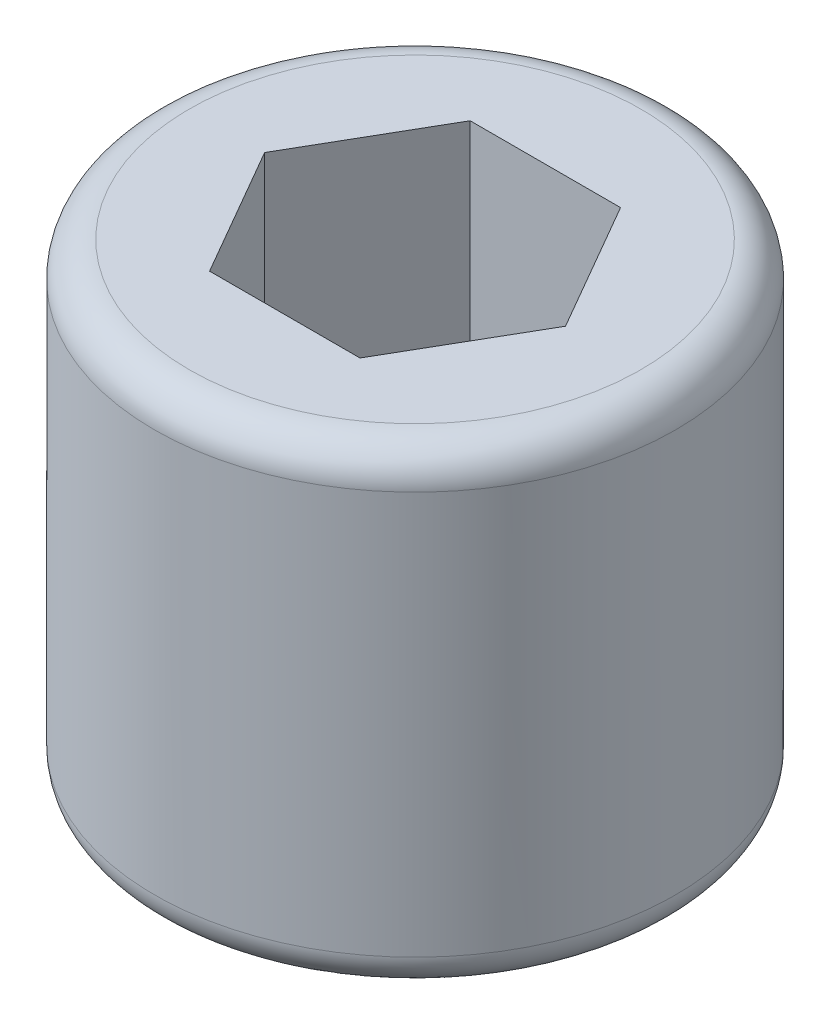
ISO-10303-21;
HEADER;
FILE_DESCRIPTION(('STEP AP214'),'2;1');
FILE_NAME('part.step','',(''),(''),'','','');
FILE_SCHEMA(('AUTOMOTIVE_DESIGN { 1 0 10303 214 1 1 1 1 }'));
ENDSEC;
DATA;
#1=APPLICATION_CONTEXT('core data for automotive mechanical design processes');
#2=APPLICATION_PROTOCOL_DEFINITION('international standard','automotive_design',2000,#1);
#3=PRODUCT_CONTEXT('',#1,'mechanical');
#4=PRODUCT('Part','Part','',(#3));
#5=PRODUCT_RELATED_PRODUCT_CATEGORY('part','',(#4));
#6=PRODUCT_DEFINITION_FORMATION('','',#4);
#7=PRODUCT_DEFINITION_CONTEXT('part definition',#1,'design');
#8=PRODUCT_DEFINITION('design','',#6,#7);
#9=PRODUCT_DEFINITION_SHAPE('','',#8);
#10=(LENGTH_UNIT() NAMED_UNIT(*) SI_UNIT(.MILLI.,.METRE.));
#11=(NAMED_UNIT(*) PLANE_ANGLE_UNIT() SI_UNIT($,.RADIAN.));
#12=(NAMED_UNIT(*) SI_UNIT($,.STERADIAN.) SOLID_ANGLE_UNIT());
#13=UNCERTAINTY_MEASURE_WITH_UNIT(LENGTH_MEASURE(1.E-05),#10,'distance_accuracy_value','');
#14=(GEOMETRIC_REPRESENTATION_CONTEXT(3) GLOBAL_UNCERTAINTY_ASSIGNED_CONTEXT((#13)) GLOBAL_UNIT_ASSIGNED_CONTEXT((#10,
#11,#12)) REPRESENTATION_CONTEXT('',''));
#15=CARTESIAN_POINT('',(0.,0.,0.));
#16=DIRECTION('',(0.,0.,1.));
#17=DIRECTION('',(1.,0.,0.));
#18=AXIS2_PLACEMENT_3D('',#15,#16,#17);
#19=CARTESIAN_POINT('',(0.,3.,0.));
#20=DIRECTION('',(0.,-1.,0.));
#21=DIRECTION('',(0.,0.,-1.));
#22=AXIS2_PLACEMENT_3D('',#19,#20,#21);
#23=CYLINDRICAL_SURFACE('',#22,1.5);
#24=CARTESIAN_POINT('',(0.,2.8,0.));
#25=DIRECTION('',(0.,1.,0.));
#26=DIRECTION('',(0.,0.,1.));
#27=AXIS2_PLACEMENT_3D('',#24,#25,#26);
#28=CIRCLE('',#27,1.5);
#29=CARTESIAN_POINT('',(0.,2.8,1.5));
#30=VERTEX_POINT('',#29);
#31=EDGE_CURVE('E43',#30,#30,#28,.F.);
#32=ORIENTED_EDGE('',*,*,#31,.T.);
#33=EDGE_LOOP('',(#32));
#34=FACE_BOUND('',#33,.T.);
#35=CARTESIAN_POINT('',(0.,0.481495457622373,0.));
#36=DIRECTION('',(0.,-1.,0.));
#37=DIRECTION('',(0.,0.,-1.));
#38=AXIS2_PLACEMENT_3D('',#35,#36,#37);
#39=CIRCLE('',#38,1.5);
#40=CARTESIAN_POINT('',(0.,0.481495457622373,-1.5));
#41=VERTEX_POINT('',#40);
#42=EDGE_CURVE('E146',#41,#41,#39,.F.);
#43=ORIENTED_EDGE('',*,*,#42,.T.);
#44=EDGE_LOOP('',(#43));
#45=FACE_BOUND('',#44,.T.);
#46=ADVANCED_FACE('F35',(#34,#45),#23,.T.);
#47=CARTESIAN_POINT('',(0.,3.,0.));
#48=DIRECTION('',(0.,1.,0.));
#49=DIRECTION('',(0.,0.,1.));
#50=AXIS2_PLACEMENT_3D('',#47,#48,#49);
#51=PLANE('',#50);
#52=CARTESIAN_POINT('',(0.,3.,0.));
#53=DIRECTION('',(0.,1.,0.));
#54=DIRECTION('',(0.,0.,1.));
#55=AXIS2_PLACEMENT_3D('',#52,#53,#54);
#56=CIRCLE('',#55,1.3);
#57=CARTESIAN_POINT('',(0.,3.,1.3));
#58=VERTEX_POINT('',#57);
#59=EDGE_CURVE('E138',#58,#58,#56,.T.);
#60=ORIENTED_EDGE('',*,*,#59,.T.);
#61=EDGE_LOOP('',(#60));
#62=FACE_BOUND('',#61,.T.);
#63=DIRECTION('',(0.5,0.,-0.866025403784439));
#64=VECTOR('',#63,1.);
#65=CARTESIAN_POINT('',(0.433012701892219,3.,0.75));
#66=LINE('',#65,#64);
#67=CARTESIAN_POINT('',(0.433012701892219,3.,0.75));
#68=VERTEX_POINT('',#67);
#69=CARTESIAN_POINT('',(0.866025403784439,3.,0.));
#70=VERTEX_POINT('',#69);
#71=EDGE_CURVE('E50',#68,#70,#66,.T.);
#72=ORIENTED_EDGE('',*,*,#71,.F.);
#73=DIRECTION('',(1.,0.,0.));
#74=VECTOR('',#73,1.);
#75=CARTESIAN_POINT('',(-0.43301270189222,3.,0.75));
#76=LINE('',#75,#74);
#77=CARTESIAN_POINT('',(-0.43301270189222,3.,0.75));
#78=VERTEX_POINT('',#77);
#79=EDGE_CURVE('E134',#78,#68,#76,.T.);
#80=ORIENTED_EDGE('',*,*,#79,.F.);
#81=DIRECTION('',(0.5,0.,0.866025403784439));
#82=VECTOR('',#81,1.);
#83=CARTESIAN_POINT('',(-0.866025403784439,3.,0.));
#84=LINE('',#83,#82);
#85=CARTESIAN_POINT('',(-0.866025403784439,3.,0.));
#86=VERTEX_POINT('',#85);
#87=EDGE_CURVE('E132',#86,#78,#84,.T.);
#88=ORIENTED_EDGE('',*,*,#87,.F.);
#89=DIRECTION('',(-0.5,0.,0.866025403784439));
#90=VECTOR('',#89,1.);
#91=CARTESIAN_POINT('',(-0.433012701892219,3.,-0.75));
#92=LINE('',#91,#90);
#93=CARTESIAN_POINT('',(-0.433012701892219,3.,-0.75));
#94=VERTEX_POINT('',#93);
#95=EDGE_CURVE('E98',#94,#86,#92,.T.);
#96=ORIENTED_EDGE('',*,*,#95,.F.);
#97=DIRECTION('',(-1.,0.,0.));
#98=VECTOR('',#97,1.);
#99=CARTESIAN_POINT('',(0.433012701892219,3.,-0.75));
#100=LINE('',#99,#98);
#101=CARTESIAN_POINT('',(0.433012701892219,3.,-0.75));
#102=VERTEX_POINT('',#101);
#103=EDGE_CURVE('E128',#102,#94,#100,.T.);
#104=ORIENTED_EDGE('',*,*,#103,.F.);
#105=DIRECTION('',(-0.5,0.,-0.866025403784439));
#106=VECTOR('',#105,1.);
#107=CARTESIAN_POINT('',(0.866025403784439,3.,0.));
#108=LINE('',#107,#106);
#109=EDGE_CURVE('E124',#70,#102,#108,.T.);
#110=ORIENTED_EDGE('',*,*,#109,.F.);
#111=EDGE_LOOP('',(#72,#80,#88,#96,#104,#110));
#112=FACE_BOUND('',#111,.T.);
#113=ADVANCED_FACE('F159',(#62,#112),#51,.T.);
#114=CARTESIAN_POINT('',(0.433012701892219,1.8,0.75));
#115=DIRECTION('',(0.866025403784439,0.,0.5));
#116=DIRECTION('',(0.5,0.,-0.866025403784439));
#117=AXIS2_PLACEMENT_3D('',#114,#115,#116);
#118=PLANE('',#117);
#119=ORIENTED_EDGE('',*,*,#71,.T.);
#120=DIRECTION('',(0.,1.,0.));
#121=VECTOR('',#120,1.);
#122=CARTESIAN_POINT('',(0.866025403784439,1.8,0.));
#123=LINE('',#122,#121);
#124=CARTESIAN_POINT('',(0.866025403784439,1.8,0.));
#125=VERTEX_POINT('',#124);
#126=EDGE_CURVE('E80',#125,#70,#123,.T.);
#127=ORIENTED_EDGE('',*,*,#126,.F.);
#128=DIRECTION('',(0.5,0.,-0.866025403784439));
#129=VECTOR('',#128,1.);
#130=CARTESIAN_POINT('',(0.433012701892219,1.8,0.75));
#131=LINE('',#130,#129);
#132=CARTESIAN_POINT('',(0.433012701892219,1.8,0.75));
#133=VERTEX_POINT('',#132);
#134=EDGE_CURVE('E136',#133,#125,#131,.T.);
#135=ORIENTED_EDGE('',*,*,#134,.F.);
#136=DIRECTION('',(0.,1.,0.));
#137=VECTOR('',#136,1.);
#138=CARTESIAN_POINT('',(0.433012701892219,1.8,0.75));
#139=LINE('',#138,#137);
#140=EDGE_CURVE('E58',#133,#68,#139,.T.);
#141=ORIENTED_EDGE('',*,*,#140,.T.);
#142=EDGE_LOOP('',(#119,#127,#135,#141));
#143=FACE_BOUND('',#142,.T.);
#144=ADVANCED_FACE('F162',(#143),#118,.F.);
#145=CARTESIAN_POINT('',(-0.43301270189222,1.8,0.75));
#146=DIRECTION('',(0.,0.,1.));
#147=DIRECTION('',(1.,0.,0.));
#148=AXIS2_PLACEMENT_3D('',#145,#146,#147);
#149=PLANE('',#148);
#150=ORIENTED_EDGE('',*,*,#79,.T.);
#151=ORIENTED_EDGE('',*,*,#140,.F.);
#152=DIRECTION('',(1.,0.,0.));
#153=VECTOR('',#152,1.);
#154=CARTESIAN_POINT('',(-0.43301270189222,1.8,0.75));
#155=LINE('',#154,#153);
#156=CARTESIAN_POINT('',(-0.43301270189222,1.8,0.75));
#157=VERTEX_POINT('',#156);
#158=EDGE_CURVE('E110',#157,#133,#155,.T.);
#159=ORIENTED_EDGE('',*,*,#158,.F.);
#160=DIRECTION('',(0.,1.,0.));
#161=VECTOR('',#160,1.);
#162=CARTESIAN_POINT('',(-0.43301270189222,1.8,0.75));
#163=LINE('',#162,#161);
#164=EDGE_CURVE('E102',#157,#78,#163,.T.);
#165=ORIENTED_EDGE('',*,*,#164,.T.);
#166=EDGE_LOOP('',(#150,#151,#159,#165));
#167=FACE_BOUND('',#166,.T.);
#168=ADVANCED_FACE('F198',(#167),#149,.F.);
#169=CARTESIAN_POINT('',(-0.866025403784439,1.8,0.));
#170=DIRECTION('',(-0.866025403784439,0.,0.5));
#171=DIRECTION('',(0.5,0.,0.866025403784439));
#172=AXIS2_PLACEMENT_3D('',#169,#170,#171);
#173=PLANE('',#172);
#174=ORIENTED_EDGE('',*,*,#87,.T.);
#175=ORIENTED_EDGE('',*,*,#164,.F.);
#176=DIRECTION('',(0.5,0.,0.866025403784439));
#177=VECTOR('',#176,1.);
#178=CARTESIAN_POINT('',(-0.866025403784439,1.8,0.));
#179=LINE('',#178,#177);
#180=CARTESIAN_POINT('',(-0.866025403784439,1.8,0.));
#181=VERTEX_POINT('',#180);
#182=EDGE_CURVE('E106',#181,#157,#179,.T.);
#183=ORIENTED_EDGE('',*,*,#182,.F.);
#184=DIRECTION('',(0.,1.,0.));
#185=VECTOR('',#184,1.);
#186=CARTESIAN_POINT('',(-0.866025403784439,1.8,0.));
#187=LINE('',#186,#185);
#188=EDGE_CURVE('E91',#181,#86,#187,.T.);
#189=ORIENTED_EDGE('',*,*,#188,.T.);
#190=EDGE_LOOP('',(#174,#175,#183,#189));
#191=FACE_BOUND('',#190,.T.);
#192=ADVANCED_FACE('F107',(#191),#173,.F.);
#193=CARTESIAN_POINT('',(-0.433012701892219,1.8,-0.75));
#194=DIRECTION('',(-0.866025403784439,0.,-0.5));
#195=DIRECTION('',(-0.5,0.,0.866025403784439));
#196=AXIS2_PLACEMENT_3D('',#193,#194,#195);
#197=PLANE('',#196);
#198=ORIENTED_EDGE('',*,*,#95,.T.);
#199=ORIENTED_EDGE('',*,*,#188,.F.);
#200=DIRECTION('',(-0.5,0.,0.866025403784439));
#201=VECTOR('',#200,1.);
#202=CARTESIAN_POINT('',(-0.433012701892219,1.8,-0.75));
#203=LINE('',#202,#201);
#204=CARTESIAN_POINT('',(-0.433012701892219,1.8,-0.75));
#205=VERTEX_POINT('',#204);
#206=EDGE_CURVE('E95',#205,#181,#203,.T.);
#207=ORIENTED_EDGE('',*,*,#206,.F.);
#208=DIRECTION('',(0.,1.,0.));
#209=VECTOR('',#208,1.);
#210=CARTESIAN_POINT('',(-0.433012701892219,1.8,-0.75));
#211=LINE('',#210,#209);
#212=EDGE_CURVE('E103',#205,#94,#211,.T.);
#213=ORIENTED_EDGE('',*,*,#212,.T.);
#214=EDGE_LOOP('',(#198,#199,#207,#213));
#215=FACE_BOUND('',#214,.T.);
#216=ADVANCED_FACE('F93',(#215),#197,.F.);
#217=CARTESIAN_POINT('',(0.433012701892219,1.8,-0.75));
#218=DIRECTION('',(0.,0.,-1.));
#219=DIRECTION('',(-1.,0.,0.));
#220=AXIS2_PLACEMENT_3D('',#217,#218,#219);
#221=PLANE('',#220);
#222=ORIENTED_EDGE('',*,*,#103,.T.);
#223=ORIENTED_EDGE('',*,*,#212,.F.);
#224=DIRECTION('',(-1.,0.,0.));
#225=VECTOR('',#224,1.);
#226=CARTESIAN_POINT('',(0.433012701892219,1.8,-0.75));
#227=LINE('',#226,#225);
#228=CARTESIAN_POINT('',(0.433012701892219,1.8,-0.75));
#229=VERTEX_POINT('',#228);
#230=EDGE_CURVE('E116',#229,#205,#227,.T.);
#231=ORIENTED_EDGE('',*,*,#230,.F.);
#232=DIRECTION('',(0.,1.,0.));
#233=VECTOR('',#232,1.);
#234=CARTESIAN_POINT('',(0.433012701892219,1.8,-0.75));
#235=LINE('',#234,#233);
#236=EDGE_CURVE('E141',#229,#102,#235,.T.);
#237=ORIENTED_EDGE('',*,*,#236,.T.);
#238=EDGE_LOOP('',(#222,#223,#231,#237));
#239=FACE_BOUND('',#238,.T.);
#240=ADVANCED_FACE('F217',(#239),#221,.F.);
#241=CARTESIAN_POINT('',(0.866025403784439,1.8,0.));
#242=DIRECTION('',(0.866025403784439,0.,-0.5));
#243=DIRECTION('',(-0.5,0.,-0.866025403784439));
#244=AXIS2_PLACEMENT_3D('',#241,#242,#243);
#245=PLANE('',#244);
#246=ORIENTED_EDGE('',*,*,#109,.T.);
#247=ORIENTED_EDGE('',*,*,#236,.F.);
#248=DIRECTION('',(-0.5,0.,-0.866025403784439));
#249=VECTOR('',#248,1.);
#250=CARTESIAN_POINT('',(0.866025403784439,1.8,0.));
#251=LINE('',#250,#249);
#252=EDGE_CURVE('E118',#125,#229,#251,.T.);
#253=ORIENTED_EDGE('',*,*,#252,.F.);
#254=ORIENTED_EDGE('',*,*,#126,.T.);
#255=EDGE_LOOP('',(#246,#247,#253,#254));
#256=FACE_BOUND('',#255,.T.);
#257=ADVANCED_FACE('F168',(#256),#245,.F.);
#258=CARTESIAN_POINT('',(0.,1.8,0.));
#259=DIRECTION('',(0.,1.,0.));
#260=DIRECTION('',(0.,0.,1.));
#261=AXIS2_PLACEMENT_3D('',#258,#259,#260);
#262=PLANE('',#261);
#263=ORIENTED_EDGE('',*,*,#134,.T.);
#264=ORIENTED_EDGE('',*,*,#252,.T.);
#265=ORIENTED_EDGE('',*,*,#230,.T.);
#266=ORIENTED_EDGE('',*,*,#206,.T.);
#267=ORIENTED_EDGE('',*,*,#182,.T.);
#268=ORIENTED_EDGE('',*,*,#158,.T.);
#269=EDGE_LOOP('',(#263,#264,#265,#266,#267,#268));
#270=FACE_BOUND('',#269,.T.);
#271=ADVANCED_FACE('F113',(#270),#262,.T.);
#272=CARTESIAN_POINT('',(0.,0.,0.));
#273=DIRECTION('',(0.,1.,0.));
#274=DIRECTION('',(0.,0.,1.));
#275=AXIS2_PLACEMENT_3D('',#272,#273,#274);
#276=CONICAL_SURFACE('',#275,0.866025403784429,1.04719755119659);
#277=CARTESIAN_POINT('',(0.,0.308290376865486,0.));
#278=DIRECTION('',(0.,-1.,0.));
#279=DIRECTION('',(0.,0.,-1.));
#280=AXIS2_PLACEMENT_3D('',#277,#278,#279);
#281=CIRCLE('',#280,1.4);
#282=CARTESIAN_POINT('',(0.,0.308290376865486,-1.4));
#283=VERTEX_POINT('',#282);
#284=EDGE_CURVE('E11',#283,#283,#281,.T.);
#285=ORIENTED_EDGE('',*,*,#284,.T.);
#286=EDGE_LOOP('',(#285));
#287=FACE_BOUND('',#286,.T.);
#288=CARTESIAN_POINT('',(0.,0.,0.));
#289=DIRECTION('',(0.,1.,0.));
#290=DIRECTION('',(0.,0.,1.));
#291=AXIS2_PLACEMENT_3D('',#288,#289,#290);
#292=CIRCLE('',#291,0.866025403784429);
#293=CARTESIAN_POINT('',(0.,0.,0.866025403784429));
#294=VERTEX_POINT('',#293);
#295=EDGE_CURVE('E125',#294,#294,#292,.T.);
#296=ORIENTED_EDGE('',*,*,#295,.T.);
#297=EDGE_LOOP('',(#296));
#298=FACE_BOUND('',#297,.T.);
#299=ADVANCED_FACE('F174',(#287,#298),#276,.T.);
#300=CARTESIAN_POINT('',(0.,0.,0.));
#301=DIRECTION('',(0.,1.,0.));
#302=DIRECTION('',(0.,0.,1.));
#303=AXIS2_PLACEMENT_3D('',#300,#301,#302);
#304=PLANE('',#303);
#305=ORIENTED_EDGE('',*,*,#295,.F.);
#306=EDGE_LOOP('',(#305));
#307=FACE_BOUND('',#306,.T.);
#308=ADVANCED_FACE('F156',(#307),#304,.F.);
#309=CARTESIAN_POINT('',(0.,2.8,0.));
#310=DIRECTION('',(0.,1.,0.));
#311=DIRECTION('',(0.,0.,1.));
#312=AXIS2_PLACEMENT_3D('',#309,#310,#311);
#313=TOROIDAL_SURFACE('',#312,1.3,0.2);
#314=ORIENTED_EDGE('',*,*,#31,.F.);
#315=EDGE_LOOP('',(#314));
#316=FACE_BOUND('',#315,.T.);
#317=ORIENTED_EDGE('',*,*,#59,.F.);
#318=EDGE_LOOP('',(#317));
#319=FACE_BOUND('',#318,.T.);
#320=ADVANCED_FACE('F153',(#316,#319),#313,.T.);
#321=CARTESIAN_POINT('',(0.,0.481495457622373,0.));
#322=DIRECTION('',(0.,-1.,0.));
#323=DIRECTION('',(0.,0.,-1.));
#324=AXIS2_PLACEMENT_3D('',#321,#322,#323);
#325=TOROIDAL_SURFACE('',#324,1.3,0.2);
#326=ORIENTED_EDGE('',*,*,#284,.F.);
#327=EDGE_LOOP('',(#326));
#328=FACE_BOUND('',#327,.T.);
#329=ORIENTED_EDGE('',*,*,#42,.F.);
#330=EDGE_LOOP('',(#329));
#331=FACE_BOUND('',#330,.T.);
#332=ADVANCED_FACE('F37',(#328,#331),#325,.T.);
#333=CLOSED_SHELL('',(#46,#113,#144,#168,#192,#216,#240,#257,#271,#299,#308,#320,#332));
#334=MANIFOLD_SOLID_BREP('B2',#333);
#335=ADVANCED_BREP_SHAPE_REPRESENTATION('',(#18,#334),#14);
#336=SHAPE_DEFINITION_REPRESENTATION(#9,#335);
ENDSEC;
END-ISO-10303-21;
